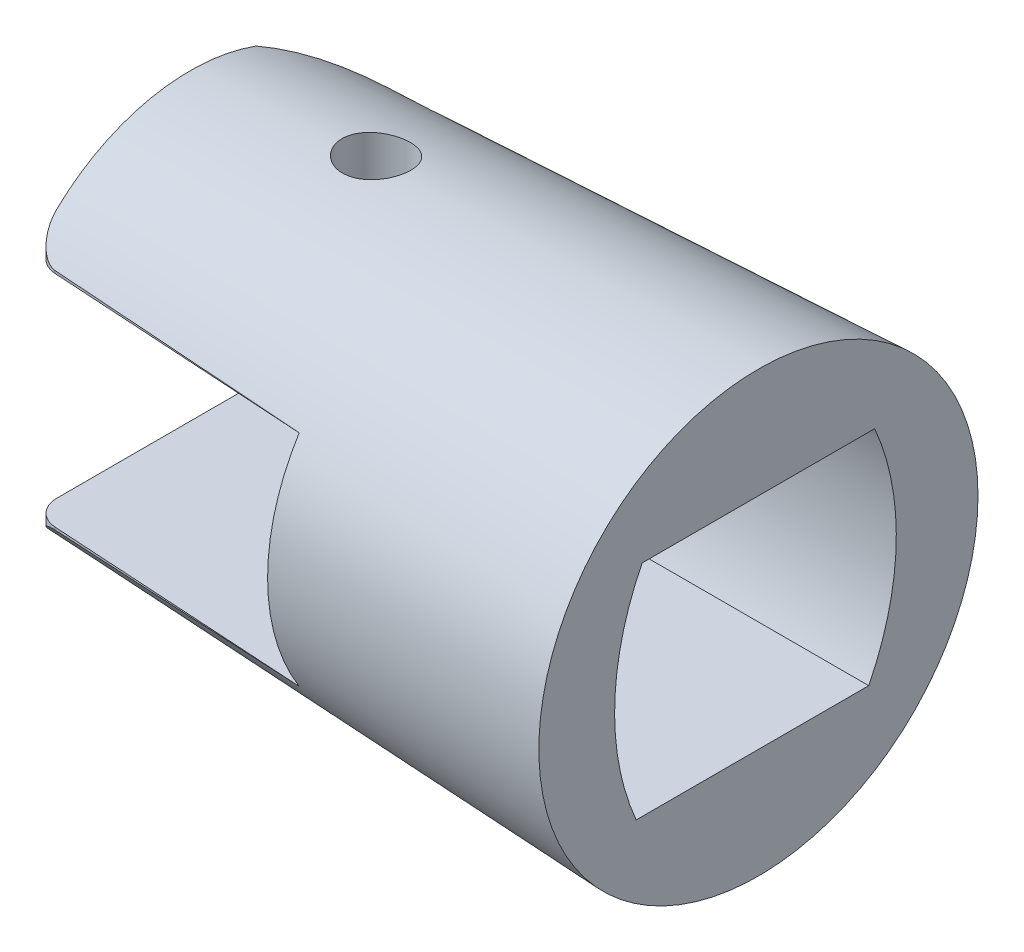
ISO-10303-21;
HEADER;
FILE_DESCRIPTION(('STEP AP214'),'2;1');
FILE_NAME('part.step','',(''),(''),'','','');
FILE_SCHEMA(('AUTOMOTIVE_DESIGN { 1 0 10303 214 1 1 1 1 }'));
ENDSEC;
DATA;
#1=APPLICATION_CONTEXT('core data for automotive mechanical design processes');
#2=APPLICATION_PROTOCOL_DEFINITION('international standard','automotive_design',2000,#1);
#3=PRODUCT_CONTEXT('',#1,'mechanical');
#4=PRODUCT('Part','Part','',(#3));
#5=PRODUCT_RELATED_PRODUCT_CATEGORY('part','',(#4));
#6=PRODUCT_DEFINITION_FORMATION('','',#4);
#7=PRODUCT_DEFINITION_CONTEXT('part definition',#1,'design');
#8=PRODUCT_DEFINITION('design','',#6,#7);
#9=PRODUCT_DEFINITION_SHAPE('','',#8);
#10=(LENGTH_UNIT() NAMED_UNIT(*) SI_UNIT(.MILLI.,.METRE.));
#11=(NAMED_UNIT(*) PLANE_ANGLE_UNIT() SI_UNIT($,.RADIAN.));
#12=(NAMED_UNIT(*) SI_UNIT($,.STERADIAN.) SOLID_ANGLE_UNIT());
#13=UNCERTAINTY_MEASURE_WITH_UNIT(LENGTH_MEASURE(1.E-05),#10,'distance_accuracy_value','');
#14=(GEOMETRIC_REPRESENTATION_CONTEXT(3) GLOBAL_UNCERTAINTY_ASSIGNED_CONTEXT((#13)) GLOBAL_UNIT_ASSIGNED_CONTEXT((#10,
#11,#12)) REPRESENTATION_CONTEXT('',''));
#15=CARTESIAN_POINT('',(0.,0.,0.));
#16=DIRECTION('',(0.,0.,1.));
#17=DIRECTION('',(1.,0.,0.));
#18=AXIS2_PLACEMENT_3D('',#15,#16,#17);
#19=CARTESIAN_POINT('',(-11.,4.25,-10.));
#20=DIRECTION('',(1.,0.,0.));
#21=DIRECTION('',(0.,1.,0.));
#22=AXIS2_PLACEMENT_3D('',#19,#20,#21);
#23=PLANE('',#22);
#24=DIRECTION('',(0.,0.,1.));
#25=VECTOR('',#24,1.);
#26=CARTESIAN_POINT('',(-11.,4.25,-10.));
#27=LINE('',#26,#25);
#28=CARTESIAN_POINT('',(-11.,4.25,4.5));
#29=VERTEX_POINT('',#28);
#30=CARTESIAN_POINT('',(-11.,4.25,6.77772085586298));
#31=VERTEX_POINT('',#30);
#32=EDGE_CURVE('E246',#29,#31,#27,.T.);
#33=ORIENTED_EDGE('',*,*,#32,.F.);
#34=CARTESIAN_POINT('',(-11.,-0.244825291906307,-4.43289122262437));
#35=DIRECTION('',(1.,0.,0.));
#36=DIRECTION('',(0.,1.,0.));
#37=AXIS2_PLACEMENT_3D('',#34,#35,#36);
#38=CIRCLE('',#37,10.);
#39=CARTESIAN_POINT('',(-11.,-4.25,4.73));
#40=VERTEX_POINT('',#39);
#41=EDGE_CURVE('E264',#29,#40,#38,.T.);
#42=ORIENTED_EDGE('',*,*,#41,.T.);
#43=DIRECTION('',(0.,0.,1.));
#44=VECTOR('',#43,1.);
#45=CARTESIAN_POINT('',(-11.,-4.25,-10.));
#46=LINE('',#45,#44);
#47=CARTESIAN_POINT('',(-11.,-4.25,6.77772085586298));
#48=VERTEX_POINT('',#47);
#49=EDGE_CURVE('E241',#40,#48,#46,.T.);
#50=ORIENTED_EDGE('',*,*,#49,.T.);
#51=CARTESIAN_POINT('',(-11.,0.,0.));
#52=DIRECTION('',(1.,0.,0.));
#53=DIRECTION('',(0.,1.,0.));
#54=AXIS2_PLACEMENT_3D('',#51,#52,#53);
#55=CIRCLE('',#54,8.);
#56=EDGE_CURVE('E372',#48,#31,#55,.F.);
#57=ORIENTED_EDGE('',*,*,#56,.T.);
#58=EDGE_LOOP('',(#33,#42,#50,#57));
#59=FACE_BOUND('',#58,.T.);
#60=ADVANCED_FACE('F40',(#59),#23,.F.);
#61=CARTESIAN_POINT('',(-24.98,4.25,-10.));
#62=DIRECTION('',(0.,1.,0.));
#63=DIRECTION('',(0.,0.,1.));
#64=AXIS2_PLACEMENT_3D('',#61,#62,#63);
#65=PLANE('',#64);
#66=DIRECTION('',(-0.998134798421867,0.,-0.0610485395348605));
#67=VECTOR('',#66,1.);
#68=CARTESIAN_POINT('',(-25.9502425122423,4.25,5.86332485192903));
#69=LINE('',#68,#67);
#70=CARTESIAN_POINT('',(-21.0610485395349,4.25,6.16236076572379));
#71=VERTEX_POINT('',#70);
#72=EDGE_CURVE('E233',#31,#71,#69,.T.);
#73=ORIENTED_EDGE('',*,*,#72,.T.);
#74=CARTESIAN_POINT('',(-21.,4.25,5.16422596730192));
#75=DIRECTION('',(0.,1.,0.));
#76=DIRECTION('',(0.,0.,1.));
#77=AXIS2_PLACEMENT_3D('',#74,#75,#76);
#78=CIRCLE('',#77,1.);
#79=CARTESIAN_POINT('',(-22.,4.25,5.16422596730192));
#80=VERTEX_POINT('',#79);
#81=EDGE_CURVE('E12',#71,#80,#78,.F.);
#82=ORIENTED_EDGE('',*,*,#81,.T.);
#83=DIRECTION('',(0.,0.,1.));
#84=VECTOR('',#83,1.);
#85=CARTESIAN_POINT('',(-22.,4.25,0.));
#86=LINE('',#85,#84);
#87=CARTESIAN_POINT('',(-22.,4.25,-2.55743670087855));
#88=VERTEX_POINT('',#87);
#89=EDGE_CURVE('E256',#88,#80,#86,.T.);
#90=ORIENTED_EDGE('',*,*,#89,.F.);
#91=CARTESIAN_POINT('',(-14.684968564774,4.25,1.44829857515455));
#92=DIRECTION('',(0.,1.,0.));
#93=DIRECTION('',(0.,0.,1.));
#94=AXIS2_PLACEMENT_3D('',#91,#92,#93);
#95=CIRCLE('',#94,8.34);
#96=CARTESIAN_POINT('',(-17.4193484103226,4.25,-6.43070941191239));
#97=VERTEX_POINT('',#96);
#98=EDGE_CURVE('E435',#88,#97,#95,.F.);
#99=ORIENTED_EDGE('',*,*,#98,.T.);
#100=CARTESIAN_POINT('',(-42.2489789704908,4.25,-5.02280092276018));
#101=CARTESIAN_POINT('',(-40.1547448333155,4.25,-5.14746541005266));
#102=CARTESIAN_POINT('',(-38.0604008324083,4.25,-5.27026605108917));
#103=CARTESIAN_POINT('',(-33.8715355023613,4.25,-5.5127282016366));
#104=CARTESIAN_POINT('',(-31.7770141736128,4.25,-5.63238971789931));
#105=CARTESIAN_POINT('',(-26.4386502473781,4.25,-5.93411425957757));
#106=CARTESIAN_POINT('',(-23.1947070161018,4.25,-6.11439444370026));
#107=CARTESIAN_POINT('',(-16.7065626101719,4.25,-6.47027431324399));
#108=CARTESIAN_POINT('',(-13.4623614353662,4.25,-6.64587399588557));
#109=CARTESIAN_POINT('',(-6.97374000545331,4.25,-6.99340072100294));
#110=CARTESIAN_POINT('',(-3.72931974897434,4.25,-7.16532773782434));
#111=CARTESIAN_POINT('',(2.75967363040063,4.25,-7.50618883644345));
#112=CARTESIAN_POINT('',(6.00424675308124,4.25,-7.67512292233899));
#113=CARTESIAN_POINT('',(9.24887897049089,4.25,-7.84290126169988));
#114=B_SPLINE_CURVE_WITH_KNOTS('',3,(#100,#101,#102,#103,#104,#105,#106,#107,#108,#109,#110,
#111,#112,#113),.UNSPECIFIED.,.F.,.F.,(4,2,2,2,2,2,4),(0.,6.29382157713554,12.5876296160741,
22.3344714842286,32.081319140289,41.8282348579779,51.575137229494),.UNSPECIFIED.);
#115=CARTESIAN_POINT('',(-11.,4.25,-6.77772085586298));
#116=VERTEX_POINT('',#115);
#117=EDGE_CURVE('E374',#97,#116,#114,.T.);
#118=ORIENTED_EDGE('',*,*,#117,.T.);
#119=CARTESIAN_POINT('',(-11.,4.25,-4.5));
#120=VERTEX_POINT('',#119);
#121=EDGE_CURVE('E242',#116,#120,#27,.T.);
#122=ORIENTED_EDGE('',*,*,#121,.T.);
#123=DIRECTION('',(1.,0.,0.));
#124=VECTOR('',#123,1.);
#125=CARTESIAN_POINT('',(-12.,4.25,-4.5));
#126=LINE('',#125,#124);
#127=CARTESIAN_POINT('',(0.,4.25,-4.5));
#128=VERTEX_POINT('',#127);
#129=EDGE_CURVE('E150',#120,#128,#126,.T.);
#130=ORIENTED_EDGE('',*,*,#129,.T.);
#131=DIRECTION('',(0.,0.,1.));
#132=VECTOR('',#131,1.);
#133=CARTESIAN_POINT('',(0.,4.25,4.5));
#134=LINE('',#133,#132);
#135=CARTESIAN_POINT('',(0.,4.25,4.5));
#136=VERTEX_POINT('',#135);
#137=EDGE_CURVE('E167',#128,#136,#134,.T.);
#138=ORIENTED_EDGE('',*,*,#137,.T.);
#139=DIRECTION('',(1.,0.,0.));
#140=VECTOR('',#139,1.);
#141=CARTESIAN_POINT('',(-12.,4.25,4.5));
#142=LINE('',#141,#140);
#143=EDGE_CURVE('E172',#29,#136,#142,.T.);
#144=ORIENTED_EDGE('',*,*,#143,.F.);
#145=ORIENTED_EDGE('',*,*,#32,.T.);
#146=EDGE_LOOP('',(#73,#82,#90,#99,#118,#122,#130,#138,#144,#145));
#147=FACE_BOUND('',#146,.T.);
#148=CARTESIAN_POINT('',(-15.3,4.25,-0.5));
#149=DIRECTION('',(0.,1.,0.));
#150=DIRECTION('',(0.,0.,1.));
#151=AXIS2_PLACEMENT_3D('',#148,#149,#150);
#152=CIRCLE('',#151,1.25);
#153=CARTESIAN_POINT('',(-15.3,4.25,0.749999999999999));
#154=VERTEX_POINT('',#153);
#155=EDGE_CURVE('E180',#154,#154,#152,.T.);
#156=ORIENTED_EDGE('',*,*,#155,.T.);
#157=EDGE_LOOP('',(#156));
#158=FACE_BOUND('',#157,.T.);
#159=ADVANCED_FACE('F211',(#147,#158),#65,.F.);
#160=CARTESIAN_POINT('',(-24.98,-4.25,-10.));
#161=DIRECTION('',(0.,-1.,0.));
#162=DIRECTION('',(0.,0.,-1.));
#163=AXIS2_PLACEMENT_3D('',#160,#161,#162);
#164=PLANE('',#163);
#165=DIRECTION('',(0.,0.,-1.));
#166=VECTOR('',#165,1.);
#167=CARTESIAN_POINT('',(-22.,-4.25,0.));
#168=LINE('',#167,#166);
#169=CARTESIAN_POINT('',(-22.,-4.25,5.16422596730192));
#170=VERTEX_POINT('',#169);
#171=CARTESIAN_POINT('',(-22.,-4.25,-2.55743670087855));
#172=VERTEX_POINT('',#171);
#173=EDGE_CURVE('E245',#170,#172,#168,.T.);
#174=ORIENTED_EDGE('',*,*,#173,.F.);
#175=CARTESIAN_POINT('',(-21.,-4.25,5.16422596730192));
#176=DIRECTION('',(0.,-1.,0.));
#177=DIRECTION('',(0.,0.,-1.));
#178=AXIS2_PLACEMENT_3D('',#175,#176,#177);
#179=CIRCLE('',#178,1.);
#180=CARTESIAN_POINT('',(-21.0610485395349,-4.25,6.16236076572379));
#181=VERTEX_POINT('',#180);
#182=EDGE_CURVE('E263',#170,#181,#179,.F.);
#183=ORIENTED_EDGE('',*,*,#182,.T.);
#184=DIRECTION('',(0.998134798421867,0.,0.0610485395348605));
#185=VECTOR('',#184,1.);
#186=CARTESIAN_POINT('',(-25.9502425122423,-4.25,5.86332485192903));
#187=LINE('',#186,#185);
#188=EDGE_CURVE('E409',#181,#48,#187,.T.);
#189=ORIENTED_EDGE('',*,*,#188,.T.);
#190=ORIENTED_EDGE('',*,*,#49,.F.);
#191=DIRECTION('',(1.,0.,0.));
#192=VECTOR('',#191,1.);
#193=CARTESIAN_POINT('',(-12.,-4.25,4.73));
#194=LINE('',#193,#192);
#195=CARTESIAN_POINT('',(0.,-4.25,4.73));
#196=VERTEX_POINT('',#195);
#197=EDGE_CURVE('E151',#40,#196,#194,.T.);
#198=ORIENTED_EDGE('',*,*,#197,.T.);
#199=DIRECTION('',(0.,0.,-1.));
#200=VECTOR('',#199,1.);
#201=CARTESIAN_POINT('',(0.,-4.25,4.73));
#202=LINE('',#201,#200);
#203=CARTESIAN_POINT('',(0.,-4.25,-4.27));
#204=VERTEX_POINT('',#203);
#205=EDGE_CURVE('E155',#196,#204,#202,.T.);
#206=ORIENTED_EDGE('',*,*,#205,.T.);
#207=DIRECTION('',(1.,0.,0.));
#208=VECTOR('',#207,1.);
#209=CARTESIAN_POINT('',(-12.,-4.25,-4.27));
#210=LINE('',#209,#208);
#211=CARTESIAN_POINT('',(-11.,-4.25,-4.27));
#212=VERTEX_POINT('',#211);
#213=EDGE_CURVE('E139',#212,#204,#210,.T.);
#214=ORIENTED_EDGE('',*,*,#213,.F.);
#215=CARTESIAN_POINT('',(-11.,-4.25,-6.77772085586298));
#216=VERTEX_POINT('',#215);
#217=EDGE_CURVE('E247',#216,#212,#46,.T.);
#218=ORIENTED_EDGE('',*,*,#217,.F.);
#219=CARTESIAN_POINT('',(9.24887897049089,-4.25,-7.84290126169988));
#220=CARTESIAN_POINT('',(6.40835558097306,-4.25,-7.69602971930408));
#221=CARTESIAN_POINT('',(3.56787831836642,-4.25,-7.54825941333675));
#222=CARTESIAN_POINT('',(-2.11295350809265,-4.25,-7.25048694328306));
#223=CARTESIAN_POINT('',(-4.95330807217747,-4.25,-7.10048478362793));
#224=CARTESIAN_POINT('',(-10.6652828942281,-4.25,-6.79614024291575));
#225=CARTESIAN_POINT('',(-13.5369015747856,-4.25,-6.64176820996603));
#226=CARTESIAN_POINT('',(-19.2799558540304,-4.25,-6.3296670944527));
#227=CARTESIAN_POINT('',(-22.1513914527715,-4.25,-6.17193801287818));
#228=CARTESIAN_POINT('',(-27.8940408836191,-4.25,-5.85227670093419));
#229=CARTESIAN_POINT('',(-30.7652547147977,-4.25,-5.69034445384187));
#230=CARTESIAN_POINT('',(-35.0718442738203,-4.25,-5.44338438491273));
#231=CARTESIAN_POINT('',(-36.5073364653289,-4.25,-5.36038736069708));
#232=CARTESIAN_POINT('',(-39.3782296889704,-4.25,-5.19282448721683));
#233=CARTESIAN_POINT('',(-40.8136307210749,-4.25,-5.1082586374663));
#234=CARTESIAN_POINT('',(-42.2489789704909,-4.25,-5.02280092276018));
#235=B_SPLINE_CURVE_WITH_KNOTS('',3,(#219,#220,#221,#222,#223,#224,#225,#226,#227,#228,#229,
#230,#231,#232,#233,#234),.UNSPECIFIED.,.F.,.F.,(4,2,2,2,2,2,2,4),(0.,8.53295409703894,
17.0658912546439,25.6931847393306,34.3204756822277,42.9478009552369,47.2614688196322,
51.5751380201726),.UNSPECIFIED.);
#236=CARTESIAN_POINT('',(-17.4193484103224,-4.25,-6.43070941191201));
#237=VERTEX_POINT('',#236);
#238=EDGE_CURVE('E367',#216,#237,#235,.T.);
#239=ORIENTED_EDGE('',*,*,#238,.T.);
#240=CARTESIAN_POINT('',(-14.684968564774,-4.25,1.44829857515455));
#241=DIRECTION('',(0.,-1.,0.));
#242=DIRECTION('',(0.,0.,-1.));
#243=AXIS2_PLACEMENT_3D('',#240,#241,#242);
#244=CIRCLE('',#243,8.34);
#245=EDGE_CURVE('E410',#237,#172,#244,.F.);
#246=ORIENTED_EDGE('',*,*,#245,.T.);
#247=EDGE_LOOP('',(#174,#183,#189,#190,#198,#206,#214,#218,#239,#246));
#248=FACE_BOUND('',#247,.T.);
#249=CARTESIAN_POINT('',(-15.3,-4.25,-0.5));
#250=DIRECTION('',(0.,-1.,0.));
#251=DIRECTION('',(0.,0.,-1.));
#252=AXIS2_PLACEMENT_3D('',#249,#250,#251);
#253=CIRCLE('',#252,1.25);
#254=CARTESIAN_POINT('',(-15.3,-4.25,-1.75));
#255=VERTEX_POINT('',#254);
#256=EDGE_CURVE('E177',#255,#255,#253,.T.);
#257=ORIENTED_EDGE('',*,*,#256,.T.);
#258=EDGE_LOOP('',(#257));
#259=FACE_BOUND('',#258,.T.);
#260=ADVANCED_FACE('F157',(#248,#259),#164,.F.);
#261=CARTESIAN_POINT('',(-22.,0.,0.));
#262=DIRECTION('',(1.,0.,0.));
#263=DIRECTION('',(0.,0.,-1.));
#264=AXIS2_PLACEMENT_3D('',#261,#262,#263);
#265=PLANE('',#264);
#266=ORIENTED_EDGE('',*,*,#89,.T.);
#267=DIRECTION('',(0.,1.,0.));
#268=VECTOR('',#267,1.);
#269=CARTESIAN_POINT('',(-22.,0.,5.16422596730192));
#270=LINE('',#269,#268);
#271=CARTESIAN_POINT('',(-22.,5.43882181659096,5.16422557510441));
#272=VERTEX_POINT('',#271);
#273=EDGE_CURVE('E283',#80,#272,#270,.T.);
#274=ORIENTED_EDGE('',*,*,#273,.T.);
#275=CARTESIAN_POINT('',(-22.,0.,0.));
#276=DIRECTION('',(1.,0.,0.));
#277=DIRECTION('',(0.,0.,-1.));
#278=AXIS2_PLACEMENT_3D('',#275,#276,#277);
#279=CIRCLE('',#278,7.5);
#280=CARTESIAN_POINT('',(-21.9999999999999,7.05049767895843,-2.5574367008788));
#281=VERTEX_POINT('',#280);
#282=EDGE_CURVE('E45',#281,#272,#279,.T.);
#283=ORIENTED_EDGE('',*,*,#282,.F.);
#284=DIRECTION('',(0.,1.,0.));
#285=VECTOR('',#284,1.);
#286=CARTESIAN_POINT('',(-22.,-10.,-2.55743670087855));
#287=LINE('',#286,#285);
#288=EDGE_CURVE('E225',#281,#88,#287,.F.);
#289=ORIENTED_EDGE('',*,*,#288,.T.);
#290=EDGE_LOOP('',(#266,#274,#283,#289));
#291=FACE_BOUND('',#290,.T.);
#292=ADVANCED_FACE('F298',(#291),#265,.F.);
#293=CARTESIAN_POINT('',(-22.,-5.438822088281,5.16422548311508));
#294=VERTEX_POINT('',#293);
#295=CARTESIAN_POINT('',(-21.9999999999998,-7.05049767895839,-2.55743670087891));
#296=VERTEX_POINT('',#295);
#297=EDGE_CURVE('E404',#294,#296,#279,.T.);
#298=ORIENTED_EDGE('',*,*,#297,.F.);
#299=DIRECTION('',(0.,1.,0.));
#300=VECTOR('',#299,1.);
#301=CARTESIAN_POINT('',(-22.,0.,5.16422596730192));
#302=LINE('',#301,#300);
#303=EDGE_CURVE('E260',#294,#170,#302,.T.);
#304=ORIENTED_EDGE('',*,*,#303,.T.);
#305=ORIENTED_EDGE('',*,*,#173,.T.);
#306=DIRECTION('',(0.,1.,0.));
#307=VECTOR('',#306,1.);
#308=CARTESIAN_POINT('',(-22.,-10.,-2.55743670087855));
#309=LINE('',#308,#307);
#310=EDGE_CURVE('E187',#172,#296,#309,.F.);
#311=ORIENTED_EDGE('',*,*,#310,.T.);
#312=EDGE_LOOP('',(#298,#304,#305,#311));
#313=FACE_BOUND('',#312,.T.);
#314=ADVANCED_FACE('F295',(#313),#265,.F.);
#315=CARTESIAN_POINT('',(0.,0.,0.));
#316=DIRECTION('',(1.,0.,0.));
#317=DIRECTION('',(0.,0.,-1.));
#318=AXIS2_PLACEMENT_3D('',#315,#316,#317);
#319=PLANE('',#318);
#320=CARTESIAN_POINT('',(0.,-0.244825291906307,-4.43289122262437));
#321=DIRECTION('',(1.,0.,0.));
#322=DIRECTION('',(0.,0.,-1.));
#323=AXIS2_PLACEMENT_3D('',#320,#321,#322);
#324=CIRCLE('',#323,10.);
#325=EDGE_CURVE('E162',#136,#196,#324,.T.);
#326=ORIENTED_EDGE('',*,*,#325,.F.);
#327=ORIENTED_EDGE('',*,*,#137,.F.);
#328=CARTESIAN_POINT('',(0.,0.244825291906306,4.66289122262437));
#329=DIRECTION('',(1.,0.,0.));
#330=DIRECTION('',(0.,0.,1.));
#331=AXIS2_PLACEMENT_3D('',#328,#329,#330);
#332=CIRCLE('',#331,10.);
#333=EDGE_CURVE('E143',#204,#128,#332,.T.);
#334=ORIENTED_EDGE('',*,*,#333,.F.);
#335=ORIENTED_EDGE('',*,*,#205,.F.);
#336=EDGE_LOOP('',(#326,#327,#334,#335));
#337=FACE_BOUND('',#336,.T.);
#338=CARTESIAN_POINT('',(0.,0.,0.));
#339=DIRECTION('',(1.,0.,0.));
#340=DIRECTION('',(0.,0.,-1.));
#341=AXIS2_PLACEMENT_3D('',#338,#339,#340);
#342=CIRCLE('',#341,8.5);
#343=CARTESIAN_POINT('',(0.,0.,-8.5));
#344=VERTEX_POINT('',#343);
#345=EDGE_CURVE('E398',#344,#344,#342,.T.);
#346=ORIENTED_EDGE('',*,*,#345,.T.);
#347=EDGE_LOOP('',(#346));
#348=FACE_BOUND('',#347,.T.);
#349=ADVANCED_FACE('F164',(#337,#348),#319,.T.);
#350=CARTESIAN_POINT('',(-22.,0.,0.));
#351=DIRECTION('',(1.,0.,0.));
#352=DIRECTION('',(0.,0.,-1.));
#353=AXIS2_PLACEMENT_3D('',#350,#351,#352);
#354=CONICAL_SURFACE('',#353,7.5,0.0454232794215771);
#355=CARTESIAN_POINT('',(-16.3553023747494,-7.66783538609269,-1.16995290718692));
#356=CARTESIAN_POINT('',(-16.3177426772586,-7.660535543052,-1.22911205122749));
#357=CARTESIAN_POINT('',(-16.2751776670152,-7.65324532273167,-1.28513974217029));
#358=CARTESIAN_POINT('',(-16.1811808162552,-7.6393583790103,-1.38935516446914));
#359=CARTESIAN_POINT('',(-16.1297409691247,-7.6327622905612,-1.43753573941932));
#360=CARTESIAN_POINT('',(-16.0193809753098,-7.62095342341407,-1.52466231388221));
#361=CARTESIAN_POINT('',(-15.9604585916029,-7.61574105984867,-1.56360554171717));
#362=CARTESIAN_POINT('',(-15.8368022406965,-7.60732878974354,-1.63106220083071));
#363=CARTESIAN_POINT('',(-15.7720699849509,-7.60412829276355,-1.65957869110723));
#364=CARTESIAN_POINT('',(-15.6395277748586,-7.60024331226885,-1.70501639608432));
#365=CARTESIAN_POINT('',(-15.5717689837345,-7.599526552491,-1.72208401622672));
#366=CARTESIAN_POINT('',(-15.434381416522,-7.60077317167195,-1.74470374369191));
#367=CARTESIAN_POINT('',(-15.3647527713586,-7.60273636346098,-1.75025665514206));
#368=CARTESIAN_POINT('',(-15.226704115902,-7.60929646234358,-1.74972895316086));
#369=CARTESIAN_POINT('',(-15.158281459089,-7.61385399261983,-1.74381916244693));
#370=CARTESIAN_POINT('',(-15.0235158858634,-7.62533432594882,-1.72095395883767));
#371=CARTESIAN_POINT('',(-14.9571730655566,-7.63225723812676,-1.70399803630419));
#372=CARTESIAN_POINT('',(-14.8277232862901,-7.64810095437488,-1.65939073418302));
#373=CARTESIAN_POINT('',(-14.7646535039709,-7.65704029945439,-1.63163824496481));
#374=CARTESIAN_POINT('',(-14.6440682305448,-7.67626942220293,-1.56628261227843));
#375=CARTESIAN_POINT('',(-14.586553570633,-7.68655940142135,-1.52867799778372));
#376=CARTESIAN_POINT('',(-14.4771017784803,-7.70806940233351,-1.44354113039382));
#377=CARTESIAN_POINT('',(-14.4253499917472,-7.71930671556947,-1.39577483321177));
#378=CARTESIAN_POINT('',(-14.33056789322,-7.74168101381902,-1.29223024770124));
#379=CARTESIAN_POINT('',(-14.2875384660664,-7.75281798854672,-1.23645114767645));
#380=CARTESIAN_POINT('',(-14.2108758810682,-7.77437290273395,-1.11755719144798));
#381=CARTESIAN_POINT('',(-14.1773749616839,-7.78477934207303,-1.05435482718266));
#382=CARTESIAN_POINT('',(-14.1215692690407,-7.80400207021944,-0.922959015415283));
#383=CARTESIAN_POINT('',(-14.0992635251842,-7.81281849683499,-0.854766001179423));
#384=CARTESIAN_POINT('',(-14.0668359603719,-7.82819810891479,-0.716311309827151));
#385=CARTESIAN_POINT('',(-14.0565481781314,-7.8347910697793,-0.646091876672315));
#386=CARTESIAN_POINT('',(-14.0480061903348,-7.84555403932394,-0.504742803048928));
#387=CARTESIAN_POINT('',(-14.0497502183628,-7.84972440357322,-0.433613297720453));
#388=CARTESIAN_POINT('',(-14.0651133238271,-7.85547330682125,-0.294174829005941));
#389=CARTESIAN_POINT('',(-14.0784635156791,-7.85710821434811,-0.225838438966091));
#390=CARTESIAN_POINT('',(-14.1163165696055,-7.85809073822465,-0.0923132187433452));
#391=CARTESIAN_POINT('',(-14.1408190445548,-7.85743843396423,-0.0271242793909864));
#392=CARTESIAN_POINT('',(-14.2000954956681,-7.85417882805215,0.0978871066119327));
#393=CARTESIAN_POINT('',(-14.2348101449692,-7.85158268795803,0.157738016929337));
#394=CARTESIAN_POINT('',(-14.3135734733701,-7.84491330709301,0.270852275142495));
#395=CARTESIAN_POINT('',(-14.3576227788653,-7.8408399671826,0.324115180574763));
#396=CARTESIAN_POINT('',(-14.4544181070386,-7.83171354651529,0.423226485521169));
#397=CARTESIAN_POINT('',(-14.5072629306409,-7.82664920497328,0.468977348587551));
#398=CARTESIAN_POINT('',(-14.619804682191,-7.81617244915915,0.551040023347231));
#399=CARTESIAN_POINT('',(-14.6795020586921,-7.81076001211167,0.587351216631512));
#400=CARTESIAN_POINT('',(-14.8048160693369,-7.80009145477537,0.649891404137965));
#401=CARTESIAN_POINT('',(-14.8704910869106,-7.79483773857488,0.676003929121559));
#402=CARTESIAN_POINT('',(-15.0053469454746,-7.78503535689263,0.716816466285035));
#403=CARTESIAN_POINT('',(-15.074527737963,-7.78048668166026,0.73151663630753));
#404=CARTESIAN_POINT('',(-15.2143362875541,-7.77243445137021,0.7490466901948));
#405=CARTESIAN_POINT('',(-15.2849617934579,-7.76892938566299,0.751893809956611));
#406=CARTESIAN_POINT('',(-15.4257320844146,-7.76310262188938,0.745654360836744));
#407=CARTESIAN_POINT('',(-15.4958768861979,-7.76078088242967,0.7365682094263));
#408=CARTESIAN_POINT('',(-15.6332515908717,-7.75727836483034,0.706794888022848));
#409=CARTESIAN_POINT('',(-15.7004963015663,-7.75609090826535,0.686176770260286));
#410=CARTESIAN_POINT('',(-15.8305926265254,-7.75459908758495,0.633968356232054));
#411=CARTESIAN_POINT('',(-15.8934441944683,-7.75429473277967,0.602377944294581));
#412=CARTESIAN_POINT('',(-16.0129801096594,-7.754191514823,0.529113443860175));
#413=CARTESIAN_POINT('',(-16.0696634058201,-7.7543927376829,0.487437640678134));
#414=CARTESIAN_POINT('',(-16.1752511403844,-7.75483499601763,0.395181847080224));
#415=CARTESIAN_POINT('',(-16.2241554485162,-7.75507603215906,0.344601707576708));
#416=CARTESIAN_POINT('',(-16.3129157775864,-7.75510945784327,0.235827061919742));
#417=CARTESIAN_POINT('',(-16.3527486291637,-7.75490071250169,0.177613643546774));
#418=CARTESIAN_POINT('',(-16.4220704508744,-7.75358535670008,0.0553348424591583));
#419=CARTESIAN_POINT('',(-16.4515599853499,-7.75247879523676,-0.00873022074318899));
#420=CARTESIAN_POINT('',(-16.4992999858227,-7.74903456270406,-0.140706773974792));
#421=CARTESIAN_POINT('',(-16.5175783774786,-7.74669997769576,-0.208608242910646));
#422=CARTESIAN_POINT('',(-16.5425108977348,-7.74062487439449,-0.346463945055798));
#423=CARTESIAN_POINT('',(-16.5491631686102,-7.73688413152914,-0.416418504510674));
#424=CARTESIAN_POINT('',(-16.5506871224864,-7.72802106082955,-0.556222160201371));
#425=CARTESIAN_POINT('',(-16.5455819960381,-7.72290147025791,-0.626071192588414));
#426=CARTESIAN_POINT('',(-16.5238301242724,-7.71149015756892,-0.763805440736827));
#427=CARTESIAN_POINT('',(-16.5071930310005,-7.70519941889934,-0.831692249381191));
#428=CARTESIAN_POINT('',(-16.4690181221882,-7.69368151547241,-0.945471526906233));
#429=CARTESIAN_POINT('',(-16.4500880429318,-7.68863792184341,-0.992276470135624));
#430=CARTESIAN_POINT('',(-16.4067356868022,-7.67833969049363,-1.08324510236338));
#431=CARTESIAN_POINT('',(-16.3823133374096,-7.67308504998695,-1.12740875647661));
#432=CARTESIAN_POINT('',(-16.3553023747494,-7.66783538609269,-1.16995290718692));
#433=B_SPLINE_CURVE_WITH_KNOTS('',3,(#355,#356,#357,#358,#359,#360,#361,#362,#363,#364,#365,
#366,#367,#368,#369,#370,#371,#372,#373,#374,#375,#376,#377,#378,#379,#380,#381,#382,#383,#384,
#385,#386,#387,#388,#389,#390,#391,#392,#393,#394,#395,#396,#397,#398,#399,#400,#401,#402,#403,
#404,#405,#406,#407,#408,#409,#410,#411,#412,#413,#414,#415,#416,#417,#418,#419,#420,#421,#422,
#423,#424,#425,#426,#427,#428,#429,#430,#431,#432),.UNSPECIFIED.,.T.,.F.,(4,2,2,2,2,2,2,2,2,2,2,
2,2,2,2,2,2,2,2,2,2,2,2,2,2,2,2,2,2,2,2,2,2,2,2,2,2,2,4),(0.,0.211182376635826,
0.422556281631093,0.633993529633579,0.845368696274652,1.05398651709415,1.2625897686394,
1.46810818639619,1.67363608687931,1.88113697395871,2.08866886079026,2.30163165427027,
2.51461603609777,2.73042617073146,2.94621759185663,3.15899244517442,3.37173606122414,
3.57967845780718,3.78761363671027,3.99436391578442,4.20112807308647,4.41039461605523,
4.61967486498258,4.83127971854001,5.04288164536952,5.25417576740741,5.46546249776979,
5.67549740441491,5.88553452535116,6.09560738122841,6.30568375474538,6.5162908115805,
6.72688637568727,6.93695521739983,7.14705762271226,7.35674597239536,7.56625902835082,
7.71812830177562,7.86999958058916),.UNSPECIFIED.);
#434=CARTESIAN_POINT('',(-16.3553023747494,-7.66783538609269,-1.16995290718692));
#435=VERTEX_POINT('',#434);
#436=EDGE_CURVE('E181',#435,#435,#433,.T.);
#437=ORIENTED_EDGE('',*,*,#436,.F.);
#438=EDGE_LOOP('',(#437));
#439=FACE_BOUND('',#438,.T.);
#440=CARTESIAN_POINT('',(-16.3553023747494,7.66783538609269,-1.16995290718692));
#441=CARTESIAN_POINT('',(-16.3929630201327,7.67515496345033,-1.1106254542659));
#442=CARTESIAN_POINT('',(-16.4256317009837,7.68249199733812,-1.04808355357981));
#443=CARTESIAN_POINT('',(-16.4800347716096,7.69659342884797,-0.918302564100755));
#444=CARTESIAN_POINT('',(-16.5017590470629,7.70335729198857,-0.851059195526678));
#445=CARTESIAN_POINT('',(-16.5335976723534,7.71583450734937,-0.713774982955396));
#446=CARTESIAN_POINT('',(-16.5437119897234,7.72154785663178,-0.643734131135636));
#447=CARTESIAN_POINT('',(-16.5519858437906,7.73162251191119,-0.50286847476824));
#448=CARTESIAN_POINT('',(-16.5501482909286,7.73598414679777,-0.432043865269496));
#449=CARTESIAN_POINT('',(-16.5345888941257,7.7432338007925,-0.292127645570486));
#450=CARTESIAN_POINT('',(-16.5209484216621,7.7461316950094,-0.223027495422222));
#451=CARTESIAN_POINT('',(-16.4822556848043,7.75060067161222,-0.0880530443623646));
#452=CARTESIAN_POINT('',(-16.4572032140972,7.75217173000938,-0.0221788017944663));
#453=CARTESIAN_POINT('',(-16.396521703972,7.7542603263011,0.104178837362151));
#454=CARTESIAN_POINT('',(-16.360937336669,7.7547822428081,0.164683627623961));
#455=CARTESIAN_POINT('',(-16.2801580833387,7.7551897165988,0.278898544069333));
#456=CARTESIAN_POINT('',(-16.2349630027986,7.75507526100169,0.332608532696593));
#457=CARTESIAN_POINT('',(-16.1360699500521,7.75468414014092,0.43188639034663));
#458=CARTESIAN_POINT('',(-16.0823442480902,7.75440693763594,0.477426637266733));
#459=CARTESIAN_POINT('',(-15.9680180193322,7.75417475980645,0.558856568291267));
#460=CARTESIAN_POINT('',(-15.9074174990592,7.7542197841762,0.594746261552427));
#461=CARTESIAN_POINT('',(-15.7809849651525,7.75505532020292,0.655893665751035));
#462=CARTESIAN_POINT('',(-15.715146823363,7.75584671724036,0.68113869804274));
#463=CARTESIAN_POINT('',(-15.5801875798921,7.75847680629614,0.720217183050057));
#464=CARTESIAN_POINT('',(-15.5110665607565,7.76031547199435,0.734050922534687));
#465=CARTESIAN_POINT('',(-15.3717249536191,7.76516295384268,0.749903384367999));
#466=CARTESIAN_POINT('',(-15.3015080789859,7.76816840578055,0.751955809782706));
#467=CARTESIAN_POINT('',(-15.1617755112916,7.7752857977993,0.744303115755266));
#468=CARTESIAN_POINT('',(-15.0922598280187,7.77939775330432,0.734597832409474));
#469=CARTESIAN_POINT('',(-14.9557807510161,7.78848124622307,0.703709122983212));
#470=CARTESIAN_POINT('',(-14.8888212204365,7.79345402636257,0.682509006765941));
#471=CARTESIAN_POINT('',(-14.7594139051082,7.80383708436239,0.629231381732339));
#472=CARTESIAN_POINT('',(-14.6969663597923,7.80924738540794,0.597153296179919));
#473=CARTESIAN_POINT('',(-14.5779317404314,7.82000189922013,0.522777160846178));
#474=CARTESIAN_POINT('',(-14.5213835792563,7.82534549070238,0.480416717738989));
#475=CARTESIAN_POINT('',(-14.4161812986718,7.83532055981638,0.386749441150285));
#476=CARTESIAN_POINT('',(-14.3675271890403,7.8399520365661,0.335442596587785));
#477=CARTESIAN_POINT('',(-14.2795629937936,7.84788658696276,0.225372336296301));
#478=CARTESIAN_POINT('',(-14.2402413570707,7.85119130632359,0.166618277944143));
#479=CARTESIAN_POINT('',(-14.1720274548344,7.85593965014056,0.0432710760314866));
#480=CARTESIAN_POINT('',(-14.1431341695622,7.85738345660559,-0.021321495824548));
#481=CARTESIAN_POINT('',(-14.0969457171868,7.85800327353496,-0.153585836291504));
#482=CARTESIAN_POINT('',(-14.0795031857614,7.85720882403735,-0.221206012109426));
#483=CARTESIAN_POINT('',(-14.0561079388416,7.85321414043614,-0.358332966023857));
#484=CARTESIAN_POINT('',(-14.050154400321,7.85001407868397,-0.427839608619549));
#485=CARTESIAN_POINT('',(-14.0498529014188,7.84126548192045,-0.566086236322735));
#486=CARTESIAN_POINT('',(-14.0553994989159,7.83573865091739,-0.634827428052371));
#487=CARTESIAN_POINT('',(-14.0776396568242,7.82257004740748,-0.770270329299658));
#488=CARTESIAN_POINT('',(-14.0943338337008,7.81492815795082,-0.836971925813593));
#489=CARTESIAN_POINT('',(-14.1385565605907,7.79785453523889,-0.967262296996413));
#490=CARTESIAN_POINT('',(-14.1662018865379,7.78840409758962,-1.03080892686776));
#491=CARTESIAN_POINT('',(-14.2314914294157,7.76835279349328,-1.15234164253561));
#492=CARTESIAN_POINT('',(-14.2691370635082,7.75775176411978,-1.21032693863893));
#493=CARTESIAN_POINT('',(-14.3543815728803,7.73583390887278,-1.32053031984693));
#494=CARTESIAN_POINT('',(-14.40219108739,7.72450618278906,-1.37258340964534));
#495=CARTESIAN_POINT('',(-14.5059256090762,7.70215416416359,-1.46794121320877));
#496=CARTESIAN_POINT('',(-14.5618513225448,7.69112989812914,-1.51124516481633));
#497=CARTESIAN_POINT('',(-14.6808968739901,7.6700752714935,-1.58824714218456));
#498=CARTESIAN_POINT('',(-14.7440783563605,7.6600550252081,-1.62185280407339));
#499=CARTESIAN_POINT('',(-14.8754734531992,7.64186654807178,-1.67786921092895));
#500=CARTESIAN_POINT('',(-14.9436864642948,7.63369809563379,-1.70028129571421));
#501=CARTESIAN_POINT('',(-15.0819154248005,7.61992998660479,-1.73283779308134));
#502=CARTESIAN_POINT('',(-15.1518762995436,7.6142864607671,-1.74319716066193));
#503=CARTESIAN_POINT('',(-15.2927024497068,7.60570501103582,-1.75196700942084));
#504=CARTESIAN_POINT('',(-15.363567544052,7.6027665537984,-1.75037984659883));
#505=CARTESIAN_POINT('',(-15.5023161886602,7.59972080961734,-1.73544171984374));
#506=CARTESIAN_POINT('',(-15.570230050164,7.59954488702212,-1.72238448828307));
#507=CARTESIAN_POINT('',(-15.7029545963731,7.60168072420432,-1.68527463035702));
#508=CARTESIAN_POINT('',(-15.7677647513332,7.6039929070856,-1.66122013430024));
#509=CARTESIAN_POINT('',(-15.8922988260274,7.61071330686873,-1.60290557483448));
#510=CARTESIAN_POINT('',(-15.9520344301247,7.61511654581999,-1.56866982081479));
#511=CARTESIAN_POINT('',(-16.0649615717881,7.62547837517157,-1.49097149218843));
#512=CARTESIAN_POINT('',(-16.1181582673142,7.63143572793634,-1.44751626472929));
#513=CARTESIAN_POINT('',(-16.203167296945,7.6425232500532,-1.36559845649871));
#514=CARTESIAN_POINT('',(-16.2368488964727,7.64743399131032,-1.32902123966432));
#515=CARTESIAN_POINT('',(-16.2996178267317,7.65750537665105,-1.25214814719342));
#516=CARTESIAN_POINT('',(-16.3287050244167,7.662666027966,-1.21185216392109));
#517=CARTESIAN_POINT('',(-16.3553023747494,7.66783538609269,-1.16995290718692));
#518=B_SPLINE_CURVE_WITH_KNOTS('',3,(#440,#441,#442,#443,#444,#445,#446,#447,#448,#449,#450,
#451,#452,#453,#454,#455,#456,#457,#458,#459,#460,#461,#462,#463,#464,#465,#466,#467,#468,#469,
#470,#471,#472,#473,#474,#475,#476,#477,#478,#479,#480,#481,#482,#483,#484,#485,#486,#487,#488,
#489,#490,#491,#492,#493,#494,#495,#496,#497,#498,#499,#500,#501,#502,#503,#504,#505,#506,#507,
#508,#509,#510,#511,#512,#513,#514,#515,#516,#517),.UNSPECIFIED.,.T.,.F.,(4,2,2,2,2,2,2,2,2,2,2,
2,2,2,2,2,2,2,2,2,2,2,2,2,2,2,2,2,2,2,2,2,2,2,2,2,2,2,4),(0.,0.211775724677872,
0.423746805465525,0.635718479025793,0.847638536570737,1.05810911509977,1.26858349879033,
1.47817762477034,1.68777599316717,1.89807018505243,2.10836417740369,2.31890794403777,
2.52944641948621,2.73938230153074,2.94932111013629,3.15956556279599,3.36982116409223,
3.5813859724942,3.79295104294156,4.00425287056387,4.21553402997967,4.42403985645412,
4.63253074583667,4.83911848585801,5.04571765120399,5.2545818644484,5.46347569202844,
5.67721551075578,5.89097394082729,6.10670560745929,6.32241144583308,6.53420825309954,
6.74596329257946,6.95244867719211,7.15896918031973,7.36500048835762,7.5708682193348,
7.72042779287963,7.86999169662848),.UNSPECIFIED.);
#519=CARTESIAN_POINT('',(-16.3553023747494,7.66783538609269,-1.16995290718692));
#520=VERTEX_POINT('',#519);
#521=EDGE_CURVE('E174',#520,#520,#518,.T.);
#522=ORIENTED_EDGE('',*,*,#521,.F.);
#523=EDGE_LOOP('',(#522));
#524=FACE_BOUND('',#523,.T.);
#525=CARTESIAN_POINT('',(-41.3966504623891,0.,4.91858206978472));
#526=DIRECTION('',(0.0610485395348605,0.,-0.998134798421867));
#527=DIRECTION('',(0.998134798421867,0.,0.0610485395348605));
#528=AXIS2_PLACEMENT_3D('',#525,#526,#527);
#529=ELLIPSE('',#528,108.411013929542,4.42830625448138);
#530=CARTESIAN_POINT('',(-21.0610485395348,-4.34940519150907,6.16236076572379));
#531=VERTEX_POINT('',#530);
#532=EDGE_CURVE('E228',#531,#48,#529,.F.);
#533=ORIENTED_EDGE('',*,*,#532,.F.);
#534=CARTESIAN_POINT('',(-21.0610485395349,-4.34940519150907,6.16236076572379));
#535=CARTESIAN_POINT('',(-21.0960037714883,-4.34960668817639,6.16026639709523));
#536=CARTESIAN_POINT('',(-21.1307027635223,-4.35255770840594,6.15626033932819));
#537=CARTESIAN_POINT('',(-21.1984264149009,-4.36323729220078,6.14492437754307));
#538=CARTESIAN_POINT('',(-21.2314649684895,-4.37091464928781,6.13763032047625));
#539=CARTESIAN_POINT('',(-21.3034159998717,-4.39276741874939,6.11798905969386));
#540=CARTESIAN_POINT('',(-21.3417552703831,-4.40808163224185,6.10483757135842));
#541=CARTESIAN_POINT('',(-21.4147941627067,-4.44349099131198,6.07500114310342));
#542=CARTESIAN_POINT('',(-21.4494762264571,-4.46360781026394,6.05830022381526));
#543=CARTESIAN_POINT('',(-21.5317973235916,-4.51834985809768,6.01298583576449));
#544=CARTESIAN_POINT('',(-21.5770255303745,-4.55514250711397,5.98264043640859));
#545=CARTESIAN_POINT('',(-21.6597061595097,-4.63324615227992,5.91759225288069));
#546=CARTESIAN_POINT('',(-21.6971420868919,-4.67456645627665,5.88288046988472));
#547=CARTESIAN_POINT('',(-21.7828896509989,-4.78221980236064,5.79100629877265));
#548=CARTESIAN_POINT('',(-21.8266110984243,-4.85030746835379,5.73161575597996));
#549=CARTESIAN_POINT('',(-21.8995032525744,-4.98881469902551,5.60704864762345));
#550=CARTESIAN_POINT('',(-21.9286643838315,-5.05923576587395,5.54186830754513));
#551=CARTESIAN_POINT('',(-21.9668930634414,-5.18172123590559,5.42471290103702));
#552=CARTESIAN_POINT('',(-21.9792240430582,-5.23375859656197,5.37375512147982));
#553=CARTESIAN_POINT('',(-21.9957402272397,-5.33701405608627,5.27015891537568));
#554=CARTESIAN_POINT('',(-21.9999585068014,-5.38823463353787,5.21752820599081));
#555=CARTESIAN_POINT('',(-21.9999999999995,-5.43882157834541,5.16422499886717));
#556=B_SPLINE_CURVE_WITH_KNOTS('',3,(#534,#535,#536,#537,#538,#539,#540,#541,#542,#543,#544,
#545,#546,#547,#548,#549,#550,#551,#552,#553,#554,#555),.UNSPECIFIED.,.F.,.F.,(4,2,2,2,2,2,2,2,
2,2,4),(0.,0.104713635229168,0.208312266464567,0.337583019397057,0.467448560866498,
0.663534383733645,0.860031158880615,1.15956187798788,1.45928932231264,1.68044771343475,
1.90070252749668),.UNSPECIFIED.);
#557=EDGE_CURVE('E273',#531,#294,#556,.T.);
#558=ORIENTED_EDGE('',*,*,#557,.T.);
#559=ORIENTED_EDGE('',*,*,#297,.T.);
#560=CARTESIAN_POINT('',(-16.5298,-3.91802554308273,-6.68510151186945));
#561=CARTESIAN_POINT('',(-16.6452650088613,-3.95234828169182,-6.65890757418157));
#562=CARTESIAN_POINT('',(-16.7591967334425,-3.98989330502452,-6.63048415725267));
#563=CARTESIAN_POINT('',(-16.9839151126902,-4.07027049339243,-6.56943206897091));
#564=CARTESIAN_POINT('',(-17.0947045107525,-4.11309786026712,-6.53680721277959));
#565=CARTESIAN_POINT('',(-17.3129376491686,-4.2028124936507,-6.4676625240574));
#566=CARTESIAN_POINT('',(-17.4203904881046,-4.24968710036639,-6.43115475976531));
#567=CARTESIAN_POINT('',(-17.6324361112313,-4.346701422204,-6.35431323693111));
#568=CARTESIAN_POINT('',(-17.7370281641467,-4.39684196129162,-6.31397851169952));
#569=CARTESIAN_POINT('',(-18.0469969682542,-4.55109589701611,-6.18729513173714));
#570=CARTESIAN_POINT('',(-18.2482720673238,-4.65891584821968,-6.09536141083783));
#571=CARTESIAN_POINT('',(-18.6409000586243,-4.87955229648103,-5.89708120253077));
#572=CARTESIAN_POINT('',(-18.832244025808,-4.99237312460562,-5.79072205089252));
#573=CARTESIAN_POINT('',(-19.2032531908943,-5.2180628869057,-5.56506569570806));
#574=CARTESIAN_POINT('',(-19.3830284573161,-5.33091595553439,-5.44593361424892));
#575=CARTESIAN_POINT('',(-19.7333529604194,-5.55518545523725,-5.1936881962222));
#576=CARTESIAN_POINT('',(-19.9039045007913,-5.66660223968927,-5.06057837535298));
#577=CARTESIAN_POINT('',(-20.2351449475529,-5.88539851093474,-4.78050951625736));
#578=CARTESIAN_POINT('',(-20.3958567420802,-5.99278712298911,-4.63358480376652));
#579=CARTESIAN_POINT('',(-20.7071504269538,-6.20157132963098,-4.32551150719415));
#580=CARTESIAN_POINT('',(-20.857734265698,-6.30296807646451,-4.1643656728179));
#581=CARTESIAN_POINT('',(-21.1890936225918,-6.52528430818577,-3.77983050139553));
#582=CARTESIAN_POINT('',(-21.3662957359246,-6.64356837686194,-3.5517626327205));
#583=CARTESIAN_POINT('',(-21.6998999278179,-6.86208134384442,-3.07187671095152));
#584=CARTESIAN_POINT('',(-21.856240625324,-6.96225725600892,-2.81999214164123));
#585=CARTESIAN_POINT('',(-22.0003080623877,-7.05068683697036,-2.55687408462598));
#586=B_SPLINE_CURVE_WITH_KNOTS('',3,(#560,#561,#562,#563,#564,#565,#566,#567,#568,#569,#570,
#571,#572,#573,#574,#575,#576,#577,#578,#579,#580,#581,#582,#583,#584,#585),.UNSPECIFIED.,.F.,
.F.,(4,2,2,2,2,2,2,2,2,2,2,2,4),(0.,0.36965414749769,0.738974962775861,1.1071797199453,
1.47547773443451,2.21307106335528,2.95131617566113,3.68096272205982,4.41042618444691,
5.13812278075181,5.86567898128326,6.79989205668421,7.73679597267253),.UNSPECIFIED.);
#587=EDGE_CURVE('E184',#237,#296,#586,.T.);
#588=ORIENTED_EDGE('',*,*,#587,.F.);
#589=ORIENTED_EDGE('',*,*,#238,.F.);
#590=EDGE_CURVE('E363',#116,#216,#55,.F.);
#591=ORIENTED_EDGE('',*,*,#590,.F.);
#592=ORIENTED_EDGE('',*,*,#117,.F.);
#593=CARTESIAN_POINT('',(-22.0003080623877,7.05068683697036,-2.55687408462598));
#594=CARTESIAN_POINT('',(-21.8864180116223,6.98076694544609,-2.76489590216897));
#595=CARTESIAN_POINT('',(-21.7648020403693,6.90348574718163,-2.96596133922815));
#596=CARTESIAN_POINT('',(-21.5079631967276,6.73684164557319,-3.35339348769184));
#597=CARTESIAN_POINT('',(-21.3727631800861,6.64749895195894,-3.53978397798605));
#598=CARTESIAN_POINT('',(-21.0905581164477,6.45935458647786,-3.89733510566367));
#599=CARTESIAN_POINT('',(-20.943582685675,6.36057653200409,-4.06853180226261));
#600=CARTESIAN_POINT('',(-20.6386937021362,6.15566350608287,-4.39626048061304));
#601=CARTESIAN_POINT('',(-20.4807754494344,6.04952537347174,-4.55278609238621));
#602=CARTESIAN_POINT('',(-20.1560452592509,5.83295695227339,-4.85019953468432));
#603=CARTESIAN_POINT('',(-19.9893007425548,5.72256057201656,-4.99118602549544));
#604=CARTESIAN_POINT('',(-19.6464476807082,5.49912175312775,-5.25890912611615));
#605=CARTESIAN_POINT('',(-19.4703396713848,5.38607946611494,-5.38564655004056));
#606=CARTESIAN_POINT('',(-19.1090857457687,5.16005697937369,-5.62486691008763));
#607=CARTESIAN_POINT('',(-18.9239518411356,5.04707688911439,-5.73736811117275));
#608=CARTESIAN_POINT('',(-18.5440998986994,4.82409995523873,-5.94831644515019));
#609=CARTESIAN_POINT('',(-18.3493829490071,4.71410277511637,-6.04676516870833));
#610=CARTESIAN_POINT('',(-18.0234935017676,4.5405293377731,-6.19558934350795));
#611=CARTESIAN_POINT('',(-17.8954219300217,4.47481669001297,-6.25028791552797));
#612=CARTESIAN_POINT('',(-17.6349758013809,4.34758252529964,-6.35379637675958));
#613=CARTESIAN_POINT('',(-17.5026038490464,4.2860585388627,-6.40260974899203));
#614=CARTESIAN_POINT('',(-17.2330641427575,4.16870993644969,-6.494188313736));
#615=CARTESIAN_POINT('',(-17.0958909168644,4.11289212775657,-6.53694630526647));
#616=CARTESIAN_POINT('',(-16.8165622715512,4.0090479304738,-6.61600319695989));
#617=CARTESIAN_POINT('',(-16.6743989921469,3.96103457226573,-6.6522913045321));
#618=CARTESIAN_POINT('',(-16.5298,3.91802554308273,-6.68510151186945));
#619=B_SPLINE_CURVE_WITH_KNOTS('',3,(#593,#594,#595,#596,#597,#598,#599,#600,#601,#602,#603,
#604,#605,#606,#607,#608,#609,#610,#611,#612,#613,#614,#615,#616,#617,#618),.UNSPECIFIED.,.F.,
.F.,(4,2,2,2,2,2,2,2,2,2,2,2,4),(0.,0.741118903165287,1.48101108438508,2.21909751178247,
2.95750293562756,3.6909111829124,4.42427750588882,5.15669317459585,5.88902587188123,
6.35079949279587,6.81229846789071,7.27434172433738,7.73714865991204),.UNSPECIFIED.);
#620=EDGE_CURVE('E223',#281,#97,#619,.T.);
#621=ORIENTED_EDGE('',*,*,#620,.F.);
#622=ORIENTED_EDGE('',*,*,#282,.T.);
#623=CARTESIAN_POINT('',(-21.9999999999997,5.43882140354224,5.16422518296511));
#624=CARTESIAN_POINT('',(-21.999988003325,5.40122433759026,5.20383005545125));
#625=CARTESIAN_POINT('',(-21.9976475021435,5.36327398371899,5.24307901185124));
#626=CARTESIAN_POINT('',(-21.9884676916384,5.28693546590571,5.32063117425542));
#627=CARTESIAN_POINT('',(-21.9816274974216,5.24854721730837,5.35893419269737));
#628=CARTESIAN_POINT('',(-21.9635269369551,5.17127647154874,5.43467828088518));
#629=CARTESIAN_POINT('',(-21.9522280107373,5.13239260596844,5.47210873056731));
#630=CARTESIAN_POINT('',(-21.9252776384547,5.05479542039122,5.54552571918466));
#631=CARTESIAN_POINT('',(-21.9096270638205,5.01608206782366,5.58151254556043));
#632=CARTESIAN_POINT('',(-21.8632611799504,4.9161187054903,5.67291560545296));
#633=CARTESIAN_POINT('',(-21.8291362822063,4.85525150425469,5.72706601404806));
#634=CARTESIAN_POINT('',(-21.7490533016695,4.73700759106301,5.82992881193549));
#635=CARTESIAN_POINT('',(-21.7031377874961,4.67961922184143,5.87865987847766));
#636=CARTESIAN_POINT('',(-21.619557864228,4.59414942754886,5.95022715826889));
#637=CARTESIAN_POINT('',(-21.5863107740471,4.56374880396908,5.97544919517082));
#638=CARTESIAN_POINT('',(-21.5146667784949,4.50666004104462,6.02268787020081));
#639=CARTESIAN_POINT('',(-21.4762744908226,4.47996861603088,6.04470734602651));
#640=CARTESIAN_POINT('',(-21.4033762618579,4.43761452517627,6.0799410572866));
#641=CARTESIAN_POINT('',(-21.3699539052249,4.42082272605747,6.09402052716757));
#642=CARTESIAN_POINT('',(-21.3000849240776,4.39183504171269,6.11885386930178));
#643=CARTESIAN_POINT('',(-21.2636492430545,4.37962334642303,6.12961915827842));
#644=CARTESIAN_POINT('',(-21.1994932868562,4.36374806339621,6.14450246364224));
#645=CARTESIAN_POINT('',(-21.1723707491004,4.35862572076492,6.14964452883506));
#646=CARTESIAN_POINT('',(-21.1172304633356,4.35153841039494,6.15772915553266));
#647=CARTESIAN_POINT('',(-21.0892082831503,4.34959278287497,6.16065818627176));
#648=CARTESIAN_POINT('',(-21.0610485395349,4.34940519150892,6.16236076572379));
#649=B_SPLINE_CURVE_WITH_KNOTS('',3,(#623,#624,#625,#626,#627,#628,#629,#630,#631,#632,#633,
#634,#635,#636,#637,#638,#639,#640,#641,#642,#643,#644,#645,#646,#647,#648),.UNSPECIFIED.,.F.,
.F.,(4,2,2,2,2,2,2,2,2,2,2,2,4),(0.,0.163752003230832,0.327536218961526,0.492769055887855,
0.657968828250644,0.922066946237109,1.18522465633723,1.33975800572191,1.49415358224949,
1.61364458887849,1.73271924287735,1.81668582207111,1.90116171903788),.UNSPECIFIED.);
#650=CARTESIAN_POINT('',(-21.0610485395349,4.34940519150907,6.16236076572379));
#651=VERTEX_POINT('',#650);
#652=EDGE_CURVE('E269',#272,#651,#649,.T.);
#653=ORIENTED_EDGE('',*,*,#652,.T.);
#654=EDGE_CURVE('E239',#31,#651,#529,.F.);
#655=ORIENTED_EDGE('',*,*,#654,.F.);
#656=ORIENTED_EDGE('',*,*,#56,.F.);
#657=EDGE_LOOP('',(#533,#558,#559,#588,#589,#591,#592,#621,#622,#653,#655,#656));
#658=FACE_BOUND('',#657,.T.);
#659=ORIENTED_EDGE('',*,*,#345,.F.);
#660=EDGE_LOOP('',(#659));
#661=FACE_BOUND('',#660,.T.);
#662=ADVANCED_FACE('F197',(#439,#524,#658,#661),#354,.T.);
#663=ORIENTED_EDGE('',*,*,#217,.T.);
#664=CARTESIAN_POINT('',(-11.,0.244825291906306,4.66289122262437));
#665=DIRECTION('',(1.,0.,0.));
#666=DIRECTION('',(0.,1.,0.));
#667=AXIS2_PLACEMENT_3D('',#664,#665,#666);
#668=CIRCLE('',#667,10.);
#669=EDGE_CURVE('E146',#212,#120,#668,.T.);
#670=ORIENTED_EDGE('',*,*,#669,.T.);
#671=ORIENTED_EDGE('',*,*,#121,.F.);
#672=ORIENTED_EDGE('',*,*,#590,.T.);
#673=EDGE_LOOP('',(#663,#670,#671,#672));
#674=FACE_BOUND('',#673,.T.);
#675=ADVANCED_FACE('F347',(#674),#23,.F.);
#676=CARTESIAN_POINT('',(-14.684968564774,-10.,1.44829857515455));
#677=DIRECTION('',(0.,1.,0.));
#678=DIRECTION('',(0.,0.,1.));
#679=AXIS2_PLACEMENT_3D('',#676,#677,#678);
#680=CYLINDRICAL_SURFACE('',#679,8.34);
#681=ORIENTED_EDGE('',*,*,#245,.F.);
#682=ORIENTED_EDGE('',*,*,#587,.T.);
#683=ORIENTED_EDGE('',*,*,#310,.F.);
#684=EDGE_LOOP('',(#681,#682,#683));
#685=FACE_BOUND('',#684,.T.);
#686=ADVANCED_FACE('F209',(#685),#680,.T.);
#687=CARTESIAN_POINT('',(-0.453994361216456,-10.,7.4227421928528));
#688=DIRECTION('',(0.0610485395348605,0.,-0.998134798421867));
#689=DIRECTION('',(-0.998134798421867,0.,-0.0610485395348605));
#690=AXIS2_PLACEMENT_3D('',#687,#688,#689);
#691=PLANE('',#690);
#692=ORIENTED_EDGE('',*,*,#188,.F.);
#693=DIRECTION('',(0.,1.,0.));
#694=VECTOR('',#693,1.);
#695=CARTESIAN_POINT('',(-21.0610485395349,-10.,6.16236076572379));
#696=LINE('',#695,#694);
#697=EDGE_CURVE('E266',#181,#531,#696,.F.);
#698=ORIENTED_EDGE('',*,*,#697,.T.);
#699=ORIENTED_EDGE('',*,*,#532,.T.);
#700=EDGE_LOOP('',(#692,#698,#699));
#701=FACE_BOUND('',#700,.T.);
#702=ADVANCED_FACE('F207',(#701),#691,.F.);
#703=ORIENTED_EDGE('',*,*,#620,.T.);
#704=ORIENTED_EDGE('',*,*,#98,.F.);
#705=ORIENTED_EDGE('',*,*,#288,.F.);
#706=EDGE_LOOP('',(#703,#704,#705));
#707=FACE_BOUND('',#706,.T.);
#708=ADVANCED_FACE('F201',(#707),#680,.T.);
#709=ORIENTED_EDGE('',*,*,#654,.T.);
#710=DIRECTION('',(0.,1.,0.));
#711=VECTOR('',#710,1.);
#712=CARTESIAN_POINT('',(-21.0610485395349,-10.,6.16236076572379));
#713=LINE('',#712,#711);
#714=EDGE_CURVE('E51',#651,#71,#713,.F.);
#715=ORIENTED_EDGE('',*,*,#714,.T.);
#716=ORIENTED_EDGE('',*,*,#72,.F.);
#717=EDGE_LOOP('',(#709,#715,#716));
#718=FACE_BOUND('',#717,.T.);
#719=ADVANCED_FACE('F206',(#718),#691,.F.);
#720=CARTESIAN_POINT('',(-15.3,-10.,-0.5));
#721=DIRECTION('',(0.,1.,0.));
#722=DIRECTION('',(0.,0.,1.));
#723=AXIS2_PLACEMENT_3D('',#720,#721,#722);
#724=CYLINDRICAL_SURFACE('',#723,1.25);
#725=ORIENTED_EDGE('',*,*,#521,.T.);
#726=EDGE_LOOP('',(#725));
#727=FACE_BOUND('',#726,.T.);
#728=ORIENTED_EDGE('',*,*,#155,.F.);
#729=EDGE_LOOP('',(#728));
#730=FACE_BOUND('',#729,.T.);
#731=ADVANCED_FACE('F331',(#727,#730),#724,.F.);
#732=ORIENTED_EDGE('',*,*,#436,.T.);
#733=EDGE_LOOP('',(#732));
#734=FACE_BOUND('',#733,.T.);
#735=ORIENTED_EDGE('',*,*,#256,.F.);
#736=EDGE_LOOP('',(#735));
#737=FACE_BOUND('',#736,.T.);
#738=ADVANCED_FACE('F335',(#734,#737),#724,.F.);
#739=CARTESIAN_POINT('',(-12.,-0.244825291906307,-4.43289122262437));
#740=DIRECTION('',(1.,0.,0.));
#741=DIRECTION('',(0.,0.,-1.));
#742=AXIS2_PLACEMENT_3D('',#739,#740,#741);
#743=CYLINDRICAL_SURFACE('',#742,10.);
#744=ORIENTED_EDGE('',*,*,#143,.T.);
#745=ORIENTED_EDGE('',*,*,#325,.T.);
#746=ORIENTED_EDGE('',*,*,#197,.F.);
#747=ORIENTED_EDGE('',*,*,#41,.F.);
#748=EDGE_LOOP('',(#744,#745,#746,#747));
#749=FACE_BOUND('',#748,.T.);
#750=ADVANCED_FACE('F337',(#749),#743,.F.);
#751=CARTESIAN_POINT('',(-12.,0.244825291906306,4.66289122262437));
#752=DIRECTION('',(1.,0.,0.));
#753=DIRECTION('',(0.,0.,-1.));
#754=AXIS2_PLACEMENT_3D('',#751,#752,#753);
#755=CYLINDRICAL_SURFACE('',#754,10.);
#756=ORIENTED_EDGE('',*,*,#213,.T.);
#757=ORIENTED_EDGE('',*,*,#333,.T.);
#758=ORIENTED_EDGE('',*,*,#129,.F.);
#759=ORIENTED_EDGE('',*,*,#669,.F.);
#760=EDGE_LOOP('',(#756,#757,#758,#759));
#761=FACE_BOUND('',#760,.T.);
#762=ADVANCED_FACE('F141',(#761),#755,.F.);
#763=CARTESIAN_POINT('',(-21.,0.,5.16422596730192));
#764=DIRECTION('',(0.,1.,0.));
#765=DIRECTION('',(0.,0.,1.));
#766=AXIS2_PLACEMENT_3D('',#763,#764,#765);
#767=CYLINDRICAL_SURFACE('',#766,1.);
#768=ORIENTED_EDGE('',*,*,#557,.F.);
#769=ORIENTED_EDGE('',*,*,#697,.F.);
#770=ORIENTED_EDGE('',*,*,#182,.F.);
#771=ORIENTED_EDGE('',*,*,#303,.F.);
#772=EDGE_LOOP('',(#768,#769,#770,#771));
#773=FACE_BOUND('',#772,.T.);
#774=ADVANCED_FACE('F291',(#773),#767,.T.);
#775=CARTESIAN_POINT('',(-21.,0.,5.16422596730192));
#776=DIRECTION('',(0.,1.,0.));
#777=DIRECTION('',(0.,0.,1.));
#778=AXIS2_PLACEMENT_3D('',#775,#776,#777);
#779=CYLINDRICAL_SURFACE('',#778,1.);
#780=ORIENTED_EDGE('',*,*,#81,.F.);
#781=ORIENTED_EDGE('',*,*,#714,.F.);
#782=ORIENTED_EDGE('',*,*,#652,.F.);
#783=ORIENTED_EDGE('',*,*,#273,.F.);
#784=EDGE_LOOP('',(#780,#781,#782,#783));
#785=FACE_BOUND('',#784,.T.);
#786=ADVANCED_FACE('F42',(#785),#779,.T.);
#787=CLOSED_SHELL('',(#60,#159,#260,#292,#314,#349,#662,#675,#686,#702,#708,#719,#731,#738,#750,
#762,#774,#786));
#788=MANIFOLD_SOLID_BREP('B2',#787);
#789=ADVANCED_BREP_SHAPE_REPRESENTATION('',(#18,#788),#14);
#790=SHAPE_DEFINITION_REPRESENTATION(#9,#789);
ENDSEC;
END-ISO-10303-21;
